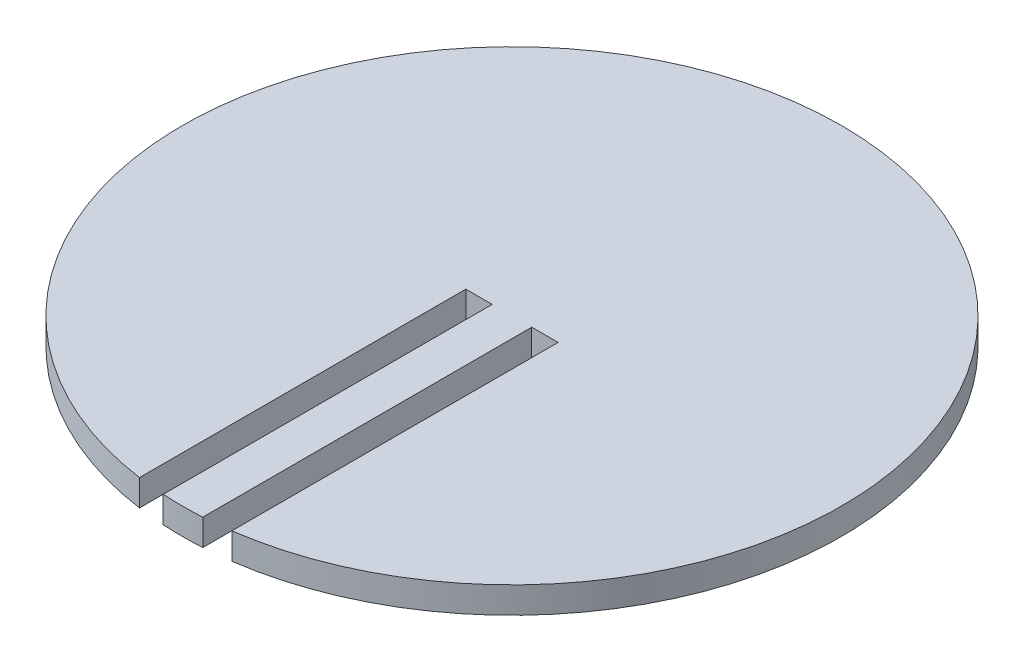
ISO-10303-21;
HEADER;
FILE_DESCRIPTION(('STEP AP214'),'2;1');
FILE_NAME('part.step','',(''),(''),'','','');
FILE_SCHEMA(('AUTOMOTIVE_DESIGN { 1 0 10303 214 1 1 1 1 }'));
ENDSEC;
DATA;
#1=APPLICATION_CONTEXT('core data for automotive mechanical design processes');
#2=APPLICATION_PROTOCOL_DEFINITION('international standard','automotive_design',2000,#1);
#3=PRODUCT_CONTEXT('',#1,'mechanical');
#4=PRODUCT('Part','Part','',(#3));
#5=PRODUCT_RELATED_PRODUCT_CATEGORY('part','',(#4));
#6=PRODUCT_DEFINITION_FORMATION('','',#4);
#7=PRODUCT_DEFINITION_CONTEXT('part definition',#1,'design');
#8=PRODUCT_DEFINITION('design','',#6,#7);
#9=PRODUCT_DEFINITION_SHAPE('','',#8);
#10=(LENGTH_UNIT() NAMED_UNIT(*) SI_UNIT(.MILLI.,.METRE.));
#11=(NAMED_UNIT(*) PLANE_ANGLE_UNIT() SI_UNIT($,.RADIAN.));
#12=(NAMED_UNIT(*) SI_UNIT($,.STERADIAN.) SOLID_ANGLE_UNIT());
#13=UNCERTAINTY_MEASURE_WITH_UNIT(LENGTH_MEASURE(1.E-05),#10,'distance_accuracy_value','');
#14=(GEOMETRIC_REPRESENTATION_CONTEXT(3) GLOBAL_UNCERTAINTY_ASSIGNED_CONTEXT((#13)) GLOBAL_UNIT_ASSIGNED_CONTEXT((#10,
#11,#12)) REPRESENTATION_CONTEXT('',''));
#15=CARTESIAN_POINT('',(0.,0.,0.));
#16=DIRECTION('',(0.,0.,1.));
#17=DIRECTION('',(1.,0.,0.));
#18=AXIS2_PLACEMENT_3D('',#15,#16,#17);
#19=CARTESIAN_POINT('',(0.,-2.54,0.));
#20=DIRECTION('',(0.,1.,0.));
#21=DIRECTION('',(0.,0.,1.));
#22=AXIS2_PLACEMENT_3D('',#19,#20,#21);
#23=CYLINDRICAL_SURFACE('',#22,31.75);
#24=CARTESIAN_POINT('',(0.,0.,0.));
#25=DIRECTION('',(0.,1.,0.));
#26=DIRECTION('',(0.,0.,1.));
#27=AXIS2_PLACEMENT_3D('',#24,#25,#26);
#28=CIRCLE('',#27,31.75);
#29=CARTESIAN_POINT('',(4.445,0.,31.4373102379959));
#30=VERTEX_POINT('',#29);
#31=CARTESIAN_POINT('',(-4.445,0.,31.4373102379959));
#32=VERTEX_POINT('',#31);
#33=EDGE_CURVE('E159',#30,#32,#28,.T.);
#34=ORIENTED_EDGE('',*,*,#33,.F.);
#35=DIRECTION('',(0.,1.,0.));
#36=VECTOR('',#35,1.);
#37=CARTESIAN_POINT('',(4.445,0.,31.4373102379959));
#38=LINE('',#37,#36);
#39=CARTESIAN_POINT('',(4.445,-2.54,31.4373102379959));
#40=VERTEX_POINT('',#39);
#41=EDGE_CURVE('E118',#30,#40,#38,.F.);
#42=ORIENTED_EDGE('',*,*,#41,.T.);
#43=CARTESIAN_POINT('',(0.,-2.54,0.));
#44=DIRECTION('',(0.,1.,0.));
#45=DIRECTION('',(0.,0.,1.));
#46=AXIS2_PLACEMENT_3D('',#43,#44,#45);
#47=CIRCLE('',#46,31.75);
#48=CARTESIAN_POINT('',(-4.445,-2.54,31.4373102379959));
#49=VERTEX_POINT('',#48);
#50=EDGE_CURVE('E45',#40,#49,#47,.T.);
#51=ORIENTED_EDGE('',*,*,#50,.T.);
#52=DIRECTION('',(0.,1.,0.));
#53=VECTOR('',#52,1.);
#54=CARTESIAN_POINT('',(-4.445,0.,31.4373102379959));
#55=LINE('',#54,#53);
#56=EDGE_CURVE('E150',#32,#49,#55,.F.);
#57=ORIENTED_EDGE('',*,*,#56,.F.);
#58=EDGE_LOOP('',(#34,#42,#51,#57));
#59=FACE_BOUND('',#58,.T.);
#60=ADVANCED_FACE('F37',(#59),#23,.T.);
#61=CARTESIAN_POINT('',(-1.905,-2.54,31.6927984722082));
#62=VERTEX_POINT('',#61);
#63=CARTESIAN_POINT('',(1.905,-2.54,31.6927984722082));
#64=VERTEX_POINT('',#63);
#65=EDGE_CURVE('E11',#62,#64,#47,.T.);
#66=ORIENTED_EDGE('',*,*,#65,.T.);
#67=DIRECTION('',(0.,1.,0.));
#68=VECTOR('',#67,1.);
#69=CARTESIAN_POINT('',(1.905,0.,31.6927984722082));
#70=LINE('',#69,#68);
#71=CARTESIAN_POINT('',(1.905,0.,31.6927984722082));
#72=VERTEX_POINT('',#71);
#73=EDGE_CURVE('E133',#72,#64,#70,.F.);
#74=ORIENTED_EDGE('',*,*,#73,.F.);
#75=CARTESIAN_POINT('',(-1.905,0.,31.6927984722082));
#76=VERTEX_POINT('',#75);
#77=EDGE_CURVE('E40',#76,#72,#28,.T.);
#78=ORIENTED_EDGE('',*,*,#77,.F.);
#79=DIRECTION('',(0.,1.,0.));
#80=VECTOR('',#79,1.);
#81=CARTESIAN_POINT('',(-1.905,0.,31.6927984722082));
#82=LINE('',#81,#80);
#83=EDGE_CURVE('E60',#76,#62,#82,.F.);
#84=ORIENTED_EDGE('',*,*,#83,.T.);
#85=EDGE_LOOP('',(#66,#74,#78,#84));
#86=FACE_BOUND('',#85,.T.);
#87=ADVANCED_FACE('F163',(#86),#23,.T.);
#88=CARTESIAN_POINT('',(0.,-2.54,0.));
#89=DIRECTION('',(0.,1.,0.));
#90=DIRECTION('',(0.,0.,1.));
#91=AXIS2_PLACEMENT_3D('',#88,#89,#90);
#92=PLANE('',#91);
#93=DIRECTION('',(0.,0.,1.));
#94=VECTOR('',#93,1.);
#95=CARTESIAN_POINT('',(4.445,-2.54,0.));
#96=LINE('',#95,#94);
#97=CARTESIAN_POINT('',(4.445,-2.54,0.));
#98=VERTEX_POINT('',#97);
#99=EDGE_CURVE('E115',#40,#98,#96,.F.);
#100=ORIENTED_EDGE('',*,*,#99,.T.);
#101=DIRECTION('',(1.,0.,0.));
#102=VECTOR('',#101,1.);
#103=CARTESIAN_POINT('',(0.,-2.54,0.));
#104=LINE('',#103,#102);
#105=CARTESIAN_POINT('',(1.905,-2.54,0.));
#106=VERTEX_POINT('',#105);
#107=EDGE_CURVE('E102',#98,#106,#104,.F.);
#108=ORIENTED_EDGE('',*,*,#107,.T.);
#109=DIRECTION('',(0.,0.,1.));
#110=VECTOR('',#109,1.);
#111=CARTESIAN_POINT('',(1.905,-2.54,0.));
#112=LINE('',#111,#110);
#113=EDGE_CURVE('E110',#106,#64,#112,.T.);
#114=ORIENTED_EDGE('',*,*,#113,.T.);
#115=ORIENTED_EDGE('',*,*,#65,.F.);
#116=DIRECTION('',(0.,0.,1.));
#117=VECTOR('',#116,1.);
#118=CARTESIAN_POINT('',(-1.905,-2.54,0.));
#119=LINE('',#118,#117);
#120=CARTESIAN_POINT('',(-1.905,-2.54,0.));
#121=VERTEX_POINT('',#120);
#122=EDGE_CURVE('E141',#62,#121,#119,.F.);
#123=ORIENTED_EDGE('',*,*,#122,.T.);
#124=DIRECTION('',(1.,0.,0.));
#125=VECTOR('',#124,1.);
#126=CARTESIAN_POINT('',(0.,-2.54,0.));
#127=LINE('',#126,#125);
#128=CARTESIAN_POINT('',(-4.445,-2.54,0.));
#129=VERTEX_POINT('',#128);
#130=EDGE_CURVE('E138',#121,#129,#127,.F.);
#131=ORIENTED_EDGE('',*,*,#130,.T.);
#132=DIRECTION('',(0.,0.,1.));
#133=VECTOR('',#132,1.);
#134=CARTESIAN_POINT('',(-4.445,-2.54,0.));
#135=LINE('',#134,#133);
#136=EDGE_CURVE('E136',#129,#49,#135,.T.);
#137=ORIENTED_EDGE('',*,*,#136,.T.);
#138=ORIENTED_EDGE('',*,*,#50,.F.);
#139=EDGE_LOOP('',(#100,#108,#114,#115,#123,#131,#137,#138));
#140=FACE_BOUND('',#139,.T.);
#141=ADVANCED_FACE('F121',(#140),#92,.F.);
#142=CARTESIAN_POINT('',(0.,0.,0.));
#143=DIRECTION('',(0.,1.,0.));
#144=DIRECTION('',(0.,0.,1.));
#145=AXIS2_PLACEMENT_3D('',#142,#143,#144);
#146=PLANE('',#145);
#147=DIRECTION('',(-1.,0.,0.));
#148=VECTOR('',#147,1.);
#149=CARTESIAN_POINT('',(1.905,0.,0.));
#150=LINE('',#149,#148);
#151=CARTESIAN_POINT('',(4.445,0.,0.));
#152=VERTEX_POINT('',#151);
#153=CARTESIAN_POINT('',(1.905,0.,0.));
#154=VERTEX_POINT('',#153);
#155=EDGE_CURVE('E127',#152,#154,#150,.T.);
#156=ORIENTED_EDGE('',*,*,#155,.F.);
#157=DIRECTION('',(0.,0.,-1.));
#158=VECTOR('',#157,1.);
#159=CARTESIAN_POINT('',(4.445,0.,0.));
#160=LINE('',#159,#158);
#161=EDGE_CURVE('E111',#30,#152,#160,.T.);
#162=ORIENTED_EDGE('',*,*,#161,.F.);
#163=ORIENTED_EDGE('',*,*,#33,.T.);
#164=DIRECTION('',(0.,0.,1.));
#165=VECTOR('',#164,1.);
#166=CARTESIAN_POINT('',(-4.445,0.,0.));
#167=LINE('',#166,#165);
#168=CARTESIAN_POINT('',(-4.445,0.,0.));
#169=VERTEX_POINT('',#168);
#170=EDGE_CURVE('E144',#169,#32,#167,.T.);
#171=ORIENTED_EDGE('',*,*,#170,.F.);
#172=DIRECTION('',(-1.,0.,0.));
#173=VECTOR('',#172,1.);
#174=CARTESIAN_POINT('',(-1.905,0.,0.));
#175=LINE('',#174,#173);
#176=CARTESIAN_POINT('',(-1.905,0.,0.));
#177=VERTEX_POINT('',#176);
#178=EDGE_CURVE('E146',#177,#169,#175,.T.);
#179=ORIENTED_EDGE('',*,*,#178,.F.);
#180=DIRECTION('',(0.,0.,-1.));
#181=VECTOR('',#180,1.);
#182=CARTESIAN_POINT('',(-1.905,0.,0.));
#183=LINE('',#182,#181);
#184=EDGE_CURVE('E134',#76,#177,#183,.T.);
#185=ORIENTED_EDGE('',*,*,#184,.F.);
#186=ORIENTED_EDGE('',*,*,#77,.T.);
#187=DIRECTION('',(0.,0.,1.));
#188=VECTOR('',#187,1.);
#189=CARTESIAN_POINT('',(1.905,0.,0.));
#190=LINE('',#189,#188);
#191=EDGE_CURVE('E129',#154,#72,#190,.T.);
#192=ORIENTED_EDGE('',*,*,#191,.F.);
#193=EDGE_LOOP('',(#156,#162,#163,#171,#179,#185,#186,#192));
#194=FACE_BOUND('',#193,.T.);
#195=ADVANCED_FACE('F169',(#194),#146,.T.);
#196=CARTESIAN_POINT('',(-1.905,0.,0.));
#197=DIRECTION('',(0.,0.,-1.));
#198=DIRECTION('',(-1.,0.,0.));
#199=AXIS2_PLACEMENT_3D('',#196,#197,#198);
#200=PLANE('',#199);
#201=DIRECTION('',(0.,1.,0.));
#202=VECTOR('',#201,1.);
#203=CARTESIAN_POINT('',(-1.905,0.,0.));
#204=LINE('',#203,#202);
#205=EDGE_CURVE('E156',#177,#121,#204,.F.);
#206=ORIENTED_EDGE('',*,*,#205,.F.);
#207=ORIENTED_EDGE('',*,*,#178,.T.);
#208=DIRECTION('',(0.,1.,0.));
#209=VECTOR('',#208,1.);
#210=CARTESIAN_POINT('',(-4.445,0.,0.));
#211=LINE('',#210,#209);
#212=EDGE_CURVE('E153',#169,#129,#211,.F.);
#213=ORIENTED_EDGE('',*,*,#212,.T.);
#214=ORIENTED_EDGE('',*,*,#130,.F.);
#215=EDGE_LOOP('',(#206,#207,#213,#214));
#216=FACE_BOUND('',#215,.T.);
#217=ADVANCED_FACE('F189',(#216),#200,.F.);
#218=CARTESIAN_POINT('',(-4.445,0.,0.));
#219=DIRECTION('',(-1.,0.,0.));
#220=DIRECTION('',(0.,0.,1.));
#221=AXIS2_PLACEMENT_3D('',#218,#219,#220);
#222=PLANE('',#221);
#223=ORIENTED_EDGE('',*,*,#212,.F.);
#224=ORIENTED_EDGE('',*,*,#170,.T.);
#225=ORIENTED_EDGE('',*,*,#56,.T.);
#226=ORIENTED_EDGE('',*,*,#136,.F.);
#227=EDGE_LOOP('',(#223,#224,#225,#226));
#228=FACE_BOUND('',#227,.T.);
#229=ADVANCED_FACE('F177',(#228),#222,.F.);
#230=CARTESIAN_POINT('',(-1.905,0.,0.));
#231=DIRECTION('',(1.,0.,0.));
#232=DIRECTION('',(0.,0.,-1.));
#233=AXIS2_PLACEMENT_3D('',#230,#231,#232);
#234=PLANE('',#233);
#235=ORIENTED_EDGE('',*,*,#184,.T.);
#236=ORIENTED_EDGE('',*,*,#205,.T.);
#237=ORIENTED_EDGE('',*,*,#122,.F.);
#238=ORIENTED_EDGE('',*,*,#83,.F.);
#239=EDGE_LOOP('',(#235,#236,#237,#238));
#240=FACE_BOUND('',#239,.T.);
#241=ADVANCED_FACE('F191',(#240),#234,.F.);
#242=CARTESIAN_POINT('',(4.445,0.,0.));
#243=DIRECTION('',(1.,0.,0.));
#244=DIRECTION('',(0.,0.,-1.));
#245=AXIS2_PLACEMENT_3D('',#242,#243,#244);
#246=PLANE('',#245);
#247=ORIENTED_EDGE('',*,*,#41,.F.);
#248=ORIENTED_EDGE('',*,*,#161,.T.);
#249=DIRECTION('',(0.,1.,0.));
#250=VECTOR('',#249,1.);
#251=CARTESIAN_POINT('',(4.445,0.,0.));
#252=LINE('',#251,#250);
#253=EDGE_CURVE('E105',#152,#98,#252,.F.);
#254=ORIENTED_EDGE('',*,*,#253,.T.);
#255=ORIENTED_EDGE('',*,*,#99,.F.);
#256=EDGE_LOOP('',(#247,#248,#254,#255));
#257=FACE_BOUND('',#256,.T.);
#258=ADVANCED_FACE('F114',(#257),#246,.F.);
#259=CARTESIAN_POINT('',(1.905,0.,0.));
#260=DIRECTION('',(0.,0.,-1.));
#261=DIRECTION('',(-1.,0.,0.));
#262=AXIS2_PLACEMENT_3D('',#259,#260,#261);
#263=PLANE('',#262);
#264=ORIENTED_EDGE('',*,*,#253,.F.);
#265=ORIENTED_EDGE('',*,*,#155,.T.);
#266=DIRECTION('',(0.,1.,0.));
#267=VECTOR('',#266,1.);
#268=CARTESIAN_POINT('',(1.905,0.,0.));
#269=LINE('',#268,#267);
#270=EDGE_CURVE('E52',#154,#106,#269,.F.);
#271=ORIENTED_EDGE('',*,*,#270,.T.);
#272=ORIENTED_EDGE('',*,*,#107,.F.);
#273=EDGE_LOOP('',(#264,#265,#271,#272));
#274=FACE_BOUND('',#273,.T.);
#275=ADVANCED_FACE('F104',(#274),#263,.F.);
#276=CARTESIAN_POINT('',(1.905,0.,0.));
#277=DIRECTION('',(-1.,0.,0.));
#278=DIRECTION('',(0.,0.,1.));
#279=AXIS2_PLACEMENT_3D('',#276,#277,#278);
#280=PLANE('',#279);
#281=ORIENTED_EDGE('',*,*,#191,.T.);
#282=ORIENTED_EDGE('',*,*,#73,.T.);
#283=ORIENTED_EDGE('',*,*,#113,.F.);
#284=ORIENTED_EDGE('',*,*,#270,.F.);
#285=EDGE_LOOP('',(#281,#282,#283,#284));
#286=FACE_BOUND('',#285,.T.);
#287=ADVANCED_FACE('F166',(#286),#280,.F.);
#288=CLOSED_SHELL('',(#60,#87,#141,#195,#217,#229,#241,#258,#275,#287));
#289=MANIFOLD_SOLID_BREP('B2',#288);
#290=ADVANCED_BREP_SHAPE_REPRESENTATION('',(#18,#289),#14);
#291=SHAPE_DEFINITION_REPRESENTATION(#9,#290);
ENDSEC;
END-ISO-10303-21;
